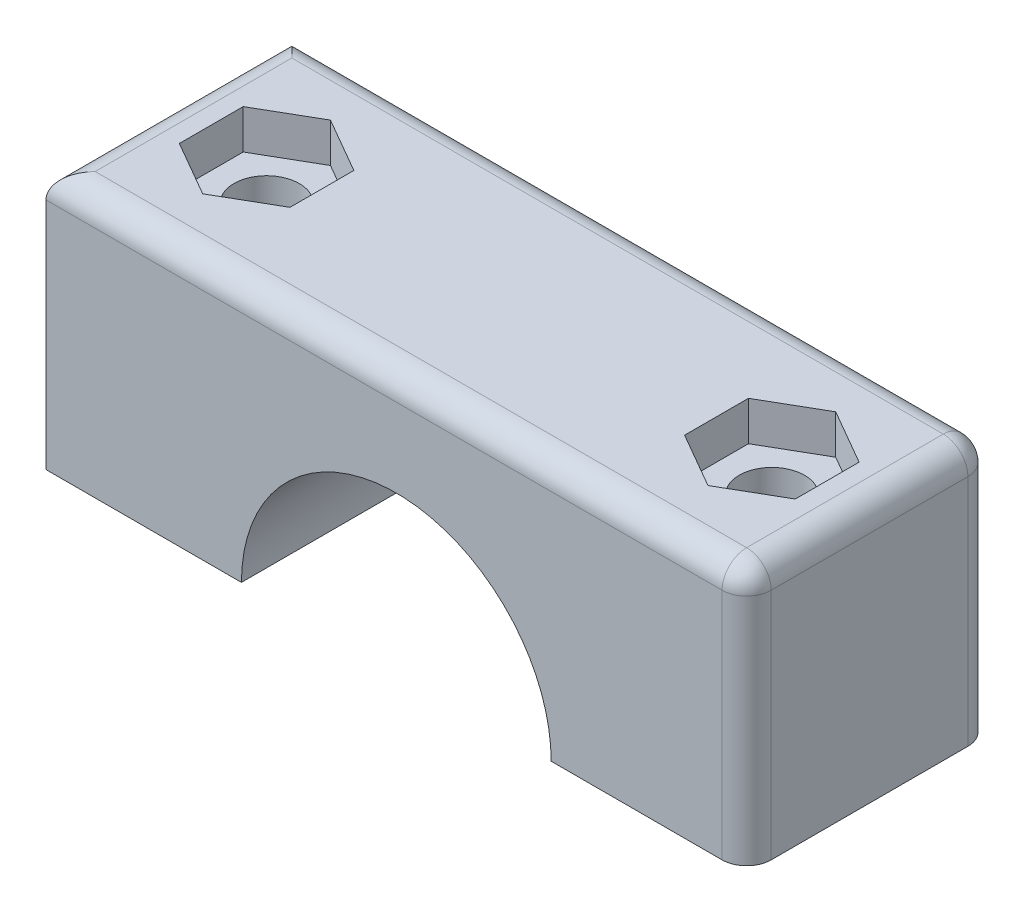
ISO-10303-21;
HEADER;
FILE_DESCRIPTION(('STEP AP214'),'2;1');
FILE_NAME('part.step','',(''),(''),'','','');
FILE_SCHEMA(('AUTOMOTIVE_DESIGN { 1 0 10303 214 1 1 1 1 }'));
ENDSEC;
DATA;
#1=APPLICATION_CONTEXT('core data for automotive mechanical design processes');
#2=APPLICATION_PROTOCOL_DEFINITION('international standard','automotive_design',2000,#1);
#3=PRODUCT_CONTEXT('',#1,'mechanical');
#4=PRODUCT('Part','Part','',(#3));
#5=PRODUCT_RELATED_PRODUCT_CATEGORY('part','',(#4));
#6=PRODUCT_DEFINITION_FORMATION('','',#4);
#7=PRODUCT_DEFINITION_CONTEXT('part definition',#1,'design');
#8=PRODUCT_DEFINITION('design','',#6,#7);
#9=PRODUCT_DEFINITION_SHAPE('','',#8);
#10=(LENGTH_UNIT() NAMED_UNIT(*) SI_UNIT(.MILLI.,.METRE.));
#11=(NAMED_UNIT(*) PLANE_ANGLE_UNIT() SI_UNIT($,.RADIAN.));
#12=(NAMED_UNIT(*) SI_UNIT($,.STERADIAN.) SOLID_ANGLE_UNIT());
#13=UNCERTAINTY_MEASURE_WITH_UNIT(LENGTH_MEASURE(1.E-05),#10,'distance_accuracy_value','');
#14=(GEOMETRIC_REPRESENTATION_CONTEXT(3) GLOBAL_UNCERTAINTY_ASSIGNED_CONTEXT((#13)) GLOBAL_UNIT_ASSIGNED_CONTEXT((#10,
#11,#12)) REPRESENTATION_CONTEXT('',''));
#15=CARTESIAN_POINT('',(0.,0.,0.));
#16=DIRECTION('',(0.,0.,1.));
#17=DIRECTION('',(1.,0.,0.));
#18=AXIS2_PLACEMENT_3D('',#15,#16,#17);
#19=CARTESIAN_POINT('',(-36.195,13.335,12.7));
#20=DIRECTION('',(0.,-1.,0.));
#21=DIRECTION('',(0.,0.,-1.));
#22=AXIS2_PLACEMENT_3D('',#19,#20,#21);
#23=PLANE('',#22);
#24=DIRECTION('',(0.,0.,-1.));
#25=VECTOR('',#24,1.);
#26=CARTESIAN_POINT('',(33.655,13.335,12.7));
#27=LINE('',#26,#25);
#28=CARTESIAN_POINT('',(33.655,13.335,10.16));
#29=VERTEX_POINT('',#28);
#30=CARTESIAN_POINT('',(33.655,13.335,-10.16));
#31=VERTEX_POINT('',#30);
#32=EDGE_CURVE('E343',#29,#31,#27,.T.);
#33=ORIENTED_EDGE('',*,*,#32,.T.);
#34=DIRECTION('',(-1.,0.,0.));
#35=VECTOR('',#34,1.);
#36=CARTESIAN_POINT('',(-36.195,13.335,-10.16));
#37=LINE('',#36,#35);
#38=CARTESIAN_POINT('',(-33.655,13.335,-10.16));
#39=VERTEX_POINT('',#38);
#40=EDGE_CURVE('E43',#31,#39,#37,.T.);
#41=ORIENTED_EDGE('',*,*,#40,.T.);
#42=DIRECTION('',(0.,0.,-1.));
#43=VECTOR('',#42,1.);
#44=CARTESIAN_POINT('',(-33.655,13.335,12.7));
#45=LINE('',#44,#43);
#46=CARTESIAN_POINT('',(-33.655,13.335,10.16));
#47=VERTEX_POINT('',#46);
#48=EDGE_CURVE('E341',#39,#47,#45,.F.);
#49=ORIENTED_EDGE('',*,*,#48,.T.);
#50=DIRECTION('',(-1.,0.,0.));
#51=VECTOR('',#50,1.);
#52=CARTESIAN_POINT('',(36.195,13.335,10.16));
#53=LINE('',#52,#51);
#54=EDGE_CURVE('E339',#47,#29,#53,.F.);
#55=ORIENTED_EDGE('',*,*,#54,.T.);
#56=EDGE_LOOP('',(#33,#41,#49,#55));
#57=FACE_BOUND('',#56,.T.);
#58=DIRECTION('',(0.866025403784439,0.,-0.5));
#59=VECTOR('',#58,1.);
#60=CARTESIAN_POINT('',(-26.1019202053862,13.335,6.59911357683742));
#61=LINE('',#60,#59);
#62=CARTESIAN_POINT('',(-26.1019202053862,13.335,6.59911357683742));
#63=VERTEX_POINT('',#62);
#64=CARTESIAN_POINT('',(-20.3869202053862,13.335,3.29955678841871));
#65=VERTEX_POINT('',#64);
#66=EDGE_CURVE('E258',#63,#65,#61,.T.);
#67=ORIENTED_EDGE('',*,*,#66,.F.);
#68=DIRECTION('',(0.866025403784439,0.,0.5));
#69=VECTOR('',#68,1.);
#70=CARTESIAN_POINT('',(-31.8169202053862,13.335,3.29955678841871));
#71=LINE('',#70,#69);
#72=CARTESIAN_POINT('',(-31.8169202053862,13.335,3.29955678841871));
#73=VERTEX_POINT('',#72);
#74=EDGE_CURVE('E59',#73,#63,#71,.T.);
#75=ORIENTED_EDGE('',*,*,#74,.F.);
#76=DIRECTION('',(0.,0.,1.));
#77=VECTOR('',#76,1.);
#78=CARTESIAN_POINT('',(-31.8169202053862,13.335,-3.29955678841871));
#79=LINE('',#78,#77);
#80=CARTESIAN_POINT('',(-31.8169202053862,13.335,-3.29955678841871));
#81=VERTEX_POINT('',#80);
#82=EDGE_CURVE('E241',#81,#73,#79,.T.);
#83=ORIENTED_EDGE('',*,*,#82,.F.);
#84=DIRECTION('',(-0.866025403784439,0.,0.5));
#85=VECTOR('',#84,1.);
#86=CARTESIAN_POINT('',(-26.1019202053862,13.335,-6.59911357683742));
#87=LINE('',#86,#85);
#88=CARTESIAN_POINT('',(-26.1019202053862,13.335,-6.59911357683742));
#89=VERTEX_POINT('',#88);
#90=EDGE_CURVE('E267',#89,#81,#87,.T.);
#91=ORIENTED_EDGE('',*,*,#90,.F.);
#92=DIRECTION('',(-0.866025403784438,0.,-0.5));
#93=VECTOR('',#92,1.);
#94=CARTESIAN_POINT('',(-20.3869202053862,13.335,-3.29955678841872));
#95=LINE('',#94,#93);
#96=CARTESIAN_POINT('',(-20.3869202053862,13.335,-3.29955678841872));
#97=VERTEX_POINT('',#96);
#98=EDGE_CURVE('E264',#97,#89,#95,.T.);
#99=ORIENTED_EDGE('',*,*,#98,.F.);
#100=DIRECTION('',(0.,0.,-1.));
#101=VECTOR('',#100,1.);
#102=CARTESIAN_POINT('',(-20.3869202053862,13.335,3.29955678841871));
#103=LINE('',#102,#101);
#104=EDGE_CURVE('E261',#65,#97,#103,.T.);
#105=ORIENTED_EDGE('',*,*,#104,.F.);
#106=EDGE_LOOP('',(#67,#75,#83,#91,#99,#105));
#107=FACE_BOUND('',#106,.T.);
#108=DIRECTION('',(-0.866025403784439,0.,0.5));
#109=VECTOR('',#108,1.);
#110=CARTESIAN_POINT('',(31.8169202053862,13.335,3.29955678841871));
#111=LINE('',#110,#109);
#112=CARTESIAN_POINT('',(31.8169202053862,13.335,3.29955678841871));
#113=VERTEX_POINT('',#112);
#114=CARTESIAN_POINT('',(26.1019202053862,13.335,6.59911357683742));
#115=VERTEX_POINT('',#114);
#116=EDGE_CURVE('E51',#113,#115,#111,.T.);
#117=ORIENTED_EDGE('',*,*,#116,.T.);
#118=DIRECTION('',(-0.866025403784439,0.,-0.5));
#119=VECTOR('',#118,1.);
#120=CARTESIAN_POINT('',(26.1019202053862,13.335,6.59911357683742));
#121=LINE('',#120,#119);
#122=CARTESIAN_POINT('',(20.3869202053862,13.335,3.29955678841871));
#123=VERTEX_POINT('',#122);
#124=EDGE_CURVE('E205',#115,#123,#121,.T.);
#125=ORIENTED_EDGE('',*,*,#124,.T.);
#126=DIRECTION('',(0.,0.,-1.));
#127=VECTOR('',#126,1.);
#128=CARTESIAN_POINT('',(20.3869202053862,13.335,3.29955678841871));
#129=LINE('',#128,#127);
#130=CARTESIAN_POINT('',(20.3869202053862,13.335,-3.29955678841872));
#131=VERTEX_POINT('',#130);
#132=EDGE_CURVE('E208',#123,#131,#129,.T.);
#133=ORIENTED_EDGE('',*,*,#132,.T.);
#134=DIRECTION('',(0.866025403784438,0.,-0.5));
#135=VECTOR('',#134,1.);
#136=CARTESIAN_POINT('',(20.3869202053862,13.335,-3.29955678841872));
#137=LINE('',#136,#135);
#138=CARTESIAN_POINT('',(26.1019202053862,13.335,-6.59911357683742));
#139=VERTEX_POINT('',#138);
#140=EDGE_CURVE('E223',#131,#139,#137,.T.);
#141=ORIENTED_EDGE('',*,*,#140,.T.);
#142=DIRECTION('',(0.866025403784439,0.,0.5));
#143=VECTOR('',#142,1.);
#144=CARTESIAN_POINT('',(26.1019202053862,13.335,-6.59911357683742));
#145=LINE('',#144,#143);
#146=CARTESIAN_POINT('',(31.8169202053862,13.335,-3.29955678841871));
#147=VERTEX_POINT('',#146);
#148=EDGE_CURVE('E220',#139,#147,#145,.T.);
#149=ORIENTED_EDGE('',*,*,#148,.T.);
#150=DIRECTION('',(0.,0.,1.));
#151=VECTOR('',#150,1.);
#152=CARTESIAN_POINT('',(31.8169202053862,13.335,-3.29955678841871));
#153=LINE('',#152,#151);
#154=EDGE_CURVE('E218',#147,#113,#153,.T.);
#155=ORIENTED_EDGE('',*,*,#154,.T.);
#156=EDGE_LOOP('',(#117,#125,#133,#141,#149,#155));
#157=FACE_BOUND('',#156,.T.);
#158=ADVANCED_FACE('F34',(#57,#107,#157),#23,.F.);
#159=CARTESIAN_POINT('',(26.1019202053862,-15.875,0.));
#160=DIRECTION('',(0.,1.,0.));
#161=DIRECTION('',(0.,0.,1.));
#162=AXIS2_PLACEMENT_3D('',#159,#160,#161);
#163=CYLINDRICAL_SURFACE('',#162,3.3782);
#164=CARTESIAN_POINT('',(26.1019202053862,-13.335,0.));
#165=DIRECTION('',(0.,1.,0.));
#166=DIRECTION('',(0.,0.,1.));
#167=AXIS2_PLACEMENT_3D('',#164,#165,#166);
#168=CIRCLE('',#167,3.3782);
#169=CARTESIAN_POINT('',(26.1019202053862,-13.335,3.3782));
#170=VERTEX_POINT('',#169);
#171=EDGE_CURVE('E288',#170,#170,#168,.F.);
#172=ORIENTED_EDGE('',*,*,#171,.T.);
#173=EDGE_LOOP('',(#172));
#174=FACE_BOUND('',#173,.T.);
#175=CARTESIAN_POINT('',(26.1019202053862,9.271,0.));
#176=DIRECTION('',(0.,1.,0.));
#177=DIRECTION('',(0.,0.,1.));
#178=AXIS2_PLACEMENT_3D('',#175,#176,#177);
#179=CIRCLE('',#178,3.3782);
#180=CARTESIAN_POINT('',(26.1019202053862,9.271,3.3782));
#181=VERTEX_POINT('',#180);
#182=EDGE_CURVE('E38',#181,#181,#179,.T.);
#183=ORIENTED_EDGE('',*,*,#182,.T.);
#184=EDGE_LOOP('',(#183));
#185=FACE_BOUND('',#184,.T.);
#186=ADVANCED_FACE('F375',(#174,#185),#163,.F.);
#187=CARTESIAN_POINT('',(-26.1019202053862,-15.875,0.));
#188=DIRECTION('',(0.,1.,0.));
#189=DIRECTION('',(0.,0.,1.));
#190=AXIS2_PLACEMENT_3D('',#187,#188,#189);
#191=CYLINDRICAL_SURFACE('',#190,3.3782);
#192=CARTESIAN_POINT('',(-26.1019202053862,-13.335,0.));
#193=DIRECTION('',(0.,1.,0.));
#194=DIRECTION('',(0.,0.,1.));
#195=AXIS2_PLACEMENT_3D('',#192,#193,#194);
#196=CIRCLE('',#195,3.3782);
#197=CARTESIAN_POINT('',(-26.1019202053862,-13.335,3.3782));
#198=VERTEX_POINT('',#197);
#199=EDGE_CURVE('E284',#198,#198,#196,.T.);
#200=ORIENTED_EDGE('',*,*,#199,.F.);
#201=EDGE_LOOP('',(#200));
#202=FACE_BOUND('',#201,.T.);
#203=CARTESIAN_POINT('',(-26.1019202053862,9.271,0.));
#204=DIRECTION('',(0.,1.,0.));
#205=DIRECTION('',(0.,0.,1.));
#206=AXIS2_PLACEMENT_3D('',#203,#204,#205);
#207=CIRCLE('',#206,3.3782);
#208=CARTESIAN_POINT('',(-26.1019202053862,9.271,3.3782));
#209=VERTEX_POINT('',#208);
#210=EDGE_CURVE('E274',#209,#209,#207,.F.);
#211=ORIENTED_EDGE('',*,*,#210,.F.);
#212=EDGE_LOOP('',(#211));
#213=FACE_BOUND('',#212,.T.);
#214=ADVANCED_FACE('F372',(#202,#213),#191,.F.);
#215=CARTESIAN_POINT('',(-36.195,-13.335,12.7));
#216=DIRECTION('',(0.,1.,0.));
#217=DIRECTION('',(0.,0.,1.));
#218=AXIS2_PLACEMENT_3D('',#215,#216,#217);
#219=PLANE('',#218);
#220=ORIENTED_EDGE('',*,*,#199,.T.);
#221=EDGE_LOOP('',(#220));
#222=FACE_BOUND('',#221,.T.);
#223=DIRECTION('',(1.,0.,0.));
#224=VECTOR('',#223,1.);
#225=CARTESIAN_POINT('',(-36.195,-13.335,-12.7));
#226=LINE('',#225,#224);
#227=CARTESIAN_POINT('',(-36.195,-13.335,-12.7));
#228=VERTEX_POINT('',#227);
#229=CARTESIAN_POINT('',(-16.002,-13.335,-12.7));
#230=VERTEX_POINT('',#229);
#231=EDGE_CURVE('E303',#228,#230,#226,.T.);
#232=ORIENTED_EDGE('',*,*,#231,.T.);
#233=DIRECTION('',(0.,0.,1.));
#234=VECTOR('',#233,1.);
#235=CARTESIAN_POINT('',(-16.002,-13.335,-12.7));
#236=LINE('',#235,#234);
#237=CARTESIAN_POINT('',(-16.002,-13.335,12.7));
#238=VERTEX_POINT('',#237);
#239=EDGE_CURVE('E296',#230,#238,#236,.T.);
#240=ORIENTED_EDGE('',*,*,#239,.T.);
#241=DIRECTION('',(1.,0.,0.));
#242=VECTOR('',#241,1.);
#243=CARTESIAN_POINT('',(-36.195,-13.335,12.7));
#244=LINE('',#243,#242);
#245=CARTESIAN_POINT('',(-36.195,-13.335,12.7));
#246=VERTEX_POINT('',#245);
#247=EDGE_CURVE('E304',#246,#238,#244,.T.);
#248=ORIENTED_EDGE('',*,*,#247,.F.);
#249=DIRECTION('',(0.,0.,-1.));
#250=VECTOR('',#249,1.);
#251=CARTESIAN_POINT('',(-36.195,-13.335,12.7));
#252=LINE('',#251,#250);
#253=EDGE_CURVE('E314',#246,#228,#252,.T.);
#254=ORIENTED_EDGE('',*,*,#253,.T.);
#255=EDGE_LOOP('',(#232,#240,#248,#254));
#256=FACE_BOUND('',#255,.T.);
#257=ADVANCED_FACE('F374',(#222,#256),#219,.F.);
#258=CARTESIAN_POINT('',(36.195,13.335,12.7));
#259=DIRECTION('',(-1.,0.,0.));
#260=DIRECTION('',(0.,-1.,0.));
#261=AXIS2_PLACEMENT_3D('',#258,#259,#260);
#262=PLANE('',#261);
#263=DIRECTION('',(0.,0.,-1.));
#264=VECTOR('',#263,1.);
#265=CARTESIAN_POINT('',(36.195,-13.335,12.7));
#266=LINE('',#265,#264);
#267=CARTESIAN_POINT('',(36.195,-13.335,10.16));
#268=VERTEX_POINT('',#267);
#269=CARTESIAN_POINT('',(36.195,-13.335,-10.16));
#270=VERTEX_POINT('',#269);
#271=EDGE_CURVE('E307',#268,#270,#266,.T.);
#272=ORIENTED_EDGE('',*,*,#271,.T.);
#273=DIRECTION('',(0.,1.,0.));
#274=VECTOR('',#273,1.);
#275=CARTESIAN_POINT('',(36.195,13.335,-10.16));
#276=LINE('',#275,#274);
#277=CARTESIAN_POINT('',(36.195,10.795,-10.16));
#278=VERTEX_POINT('',#277);
#279=EDGE_CURVE('E324',#270,#278,#276,.T.);
#280=ORIENTED_EDGE('',*,*,#279,.T.);
#281=DIRECTION('',(0.,0.,-1.));
#282=VECTOR('',#281,1.);
#283=CARTESIAN_POINT('',(36.195,10.795,12.7));
#284=LINE('',#283,#282);
#285=CARTESIAN_POINT('',(36.195,10.795,10.16));
#286=VERTEX_POINT('',#285);
#287=EDGE_CURVE('E317',#278,#286,#284,.F.);
#288=ORIENTED_EDGE('',*,*,#287,.T.);
#289=DIRECTION('',(0.,1.,0.));
#290=VECTOR('',#289,1.);
#291=CARTESIAN_POINT('',(36.195,-13.335,10.16));
#292=LINE('',#291,#290);
#293=EDGE_CURVE('E322',#286,#268,#292,.F.);
#294=ORIENTED_EDGE('',*,*,#293,.T.);
#295=EDGE_LOOP('',(#272,#280,#288,#294));
#296=FACE_BOUND('',#295,.T.);
#297=ADVANCED_FACE('F382',(#296),#262,.F.);
#298=CARTESIAN_POINT('',(-36.195,13.335,12.7));
#299=DIRECTION('',(1.,0.,0.));
#300=DIRECTION('',(0.,0.,-1.));
#301=AXIS2_PLACEMENT_3D('',#298,#299,#300);
#302=PLANE('',#301);
#303=DIRECTION('',(0.,-1.,0.));
#304=VECTOR('',#303,1.);
#305=CARTESIAN_POINT('',(-36.195,13.335,12.7));
#306=LINE('',#305,#304);
#307=CARTESIAN_POINT('',(-36.195,10.795,12.7));
#308=VERTEX_POINT('',#307);
#309=EDGE_CURVE('E300',#308,#246,#306,.T.);
#310=ORIENTED_EDGE('',*,*,#309,.F.);
#311=DIRECTION('',(0.,0.,-1.));
#312=VECTOR('',#311,1.);
#313=CARTESIAN_POINT('',(-36.195,10.795,12.7));
#314=LINE('',#313,#312);
#315=CARTESIAN_POINT('',(-36.195,10.795,-12.7));
#316=VERTEX_POINT('',#315);
#317=EDGE_CURVE('E11',#308,#316,#314,.T.);
#318=ORIENTED_EDGE('',*,*,#317,.T.);
#319=DIRECTION('',(0.,-1.,0.));
#320=VECTOR('',#319,1.);
#321=CARTESIAN_POINT('',(-36.195,13.335,-12.7));
#322=LINE('',#321,#320);
#323=EDGE_CURVE('E299',#316,#228,#322,.T.);
#324=ORIENTED_EDGE('',*,*,#323,.T.);
#325=ORIENTED_EDGE('',*,*,#253,.F.);
#326=EDGE_LOOP('',(#310,#318,#324,#325));
#327=FACE_BOUND('',#326,.T.);
#328=ADVANCED_FACE('F398',(#327),#302,.F.);
#329=ORIENTED_EDGE('',*,*,#171,.F.);
#330=EDGE_LOOP('',(#329));
#331=FACE_BOUND('',#330,.T.);
#332=CARTESIAN_POINT('',(16.002,-13.335,-12.7));
#333=VERTEX_POINT('',#332);
#334=CARTESIAN_POINT('',(33.655,-13.335,-12.7));
#335=VERTEX_POINT('',#334);
#336=EDGE_CURVE('E309',#333,#335,#226,.T.);
#337=ORIENTED_EDGE('',*,*,#336,.T.);
#338=CARTESIAN_POINT('',(33.655,-13.335,-10.16));
#339=DIRECTION('',(0.,1.,0.));
#340=DIRECTION('',(0.,0.,1.));
#341=AXIS2_PLACEMENT_3D('',#338,#339,#340);
#342=CIRCLE('',#341,2.54);
#343=EDGE_CURVE('E333',#335,#270,#342,.F.);
#344=ORIENTED_EDGE('',*,*,#343,.T.);
#345=ORIENTED_EDGE('',*,*,#271,.F.);
#346=CARTESIAN_POINT('',(33.655,-13.335,10.16));
#347=DIRECTION('',(0.,1.,0.));
#348=DIRECTION('',(0.,0.,1.));
#349=AXIS2_PLACEMENT_3D('',#346,#347,#348);
#350=CIRCLE('',#349,2.54);
#351=CARTESIAN_POINT('',(33.655,-13.335,12.7));
#352=VERTEX_POINT('',#351);
#353=EDGE_CURVE('E331',#268,#352,#350,.F.);
#354=ORIENTED_EDGE('',*,*,#353,.T.);
#355=CARTESIAN_POINT('',(16.002,-13.335,12.7));
#356=VERTEX_POINT('',#355);
#357=EDGE_CURVE('E302',#356,#352,#244,.T.);
#358=ORIENTED_EDGE('',*,*,#357,.F.);
#359=DIRECTION('',(0.,0.,1.));
#360=VECTOR('',#359,1.);
#361=CARTESIAN_POINT('',(16.002,-13.335,-12.7));
#362=LINE('',#361,#360);
#363=EDGE_CURVE('E292',#356,#333,#362,.F.);
#364=ORIENTED_EDGE('',*,*,#363,.T.);
#365=EDGE_LOOP('',(#337,#344,#345,#354,#358,#364));
#366=FACE_BOUND('',#365,.T.);
#367=ADVANCED_FACE('F385',(#331,#366),#219,.F.);
#368=CARTESIAN_POINT('',(0.,0.,12.7));
#369=DIRECTION('',(0.,0.,1.));
#370=DIRECTION('',(1.,0.,0.));
#371=AXIS2_PLACEMENT_3D('',#368,#369,#370);
#372=PLANE('',#371);
#373=ORIENTED_EDGE('',*,*,#357,.T.);
#374=DIRECTION('',(0.,1.,0.));
#375=VECTOR('',#374,1.);
#376=CARTESIAN_POINT('',(33.655,13.335,12.7));
#377=LINE('',#376,#375);
#378=CARTESIAN_POINT('',(33.655,10.795,12.7));
#379=VERTEX_POINT('',#378);
#380=EDGE_CURVE('E337',#352,#379,#377,.T.);
#381=ORIENTED_EDGE('',*,*,#380,.T.);
#382=DIRECTION('',(-1.,0.,0.));
#383=VECTOR('',#382,1.);
#384=CARTESIAN_POINT('',(-36.195,10.795,12.7));
#385=LINE('',#384,#383);
#386=EDGE_CURVE('E335',#379,#308,#385,.T.);
#387=ORIENTED_EDGE('',*,*,#386,.T.);
#388=ORIENTED_EDGE('',*,*,#309,.T.);
#389=ORIENTED_EDGE('',*,*,#247,.T.);
#390=CARTESIAN_POINT('',(0.,-13.335,12.7));
#391=DIRECTION('',(0.,0.,1.));
#392=DIRECTION('',(1.,0.,0.));
#393=AXIS2_PLACEMENT_3D('',#390,#391,#392);
#394=CIRCLE('',#393,16.002);
#395=EDGE_CURVE('E287',#356,#238,#394,.T.);
#396=ORIENTED_EDGE('',*,*,#395,.F.);
#397=EDGE_LOOP('',(#373,#381,#387,#388,#389,#396));
#398=FACE_BOUND('',#397,.T.);
#399=ADVANCED_FACE('F456',(#398),#372,.T.);
#400=CARTESIAN_POINT('',(0.,0.,-12.7));
#401=DIRECTION('',(0.,0.,1.));
#402=DIRECTION('',(1.,0.,0.));
#403=AXIS2_PLACEMENT_3D('',#400,#401,#402);
#404=PLANE('',#403);
#405=DIRECTION('',(-1.,0.,0.));
#406=VECTOR('',#405,1.);
#407=CARTESIAN_POINT('',(0.,10.795,-12.7));
#408=LINE('',#407,#406);
#409=CARTESIAN_POINT('',(33.655,10.795,-12.7));
#410=VERTEX_POINT('',#409);
#411=EDGE_CURVE('E327',#316,#410,#408,.F.);
#412=ORIENTED_EDGE('',*,*,#411,.T.);
#413=DIRECTION('',(0.,1.,0.));
#414=VECTOR('',#413,1.);
#415=CARTESIAN_POINT('',(33.655,0.,-12.7));
#416=LINE('',#415,#414);
#417=EDGE_CURVE('E329',#410,#335,#416,.F.);
#418=ORIENTED_EDGE('',*,*,#417,.T.);
#419=ORIENTED_EDGE('',*,*,#336,.F.);
#420=CARTESIAN_POINT('',(0.,-13.335,-12.7));
#421=DIRECTION('',(0.,0.,1.));
#422=DIRECTION('',(1.,0.,0.));
#423=AXIS2_PLACEMENT_3D('',#420,#421,#422);
#424=CIRCLE('',#423,16.002);
#425=EDGE_CURVE('E289',#333,#230,#424,.T.);
#426=ORIENTED_EDGE('',*,*,#425,.T.);
#427=ORIENTED_EDGE('',*,*,#231,.F.);
#428=ORIENTED_EDGE('',*,*,#323,.F.);
#429=EDGE_LOOP('',(#412,#418,#419,#426,#427,#428));
#430=FACE_BOUND('',#429,.T.);
#431=ADVANCED_FACE('F448',(#430),#404,.F.);
#432=CARTESIAN_POINT('',(0.,-13.335,-12.7));
#433=DIRECTION('',(0.,0.,1.));
#434=DIRECTION('',(1.,0.,0.));
#435=AXIS2_PLACEMENT_3D('',#432,#433,#434);
#436=CYLINDRICAL_SURFACE('',#435,16.002);
#437=ORIENTED_EDGE('',*,*,#425,.F.);
#438=ORIENTED_EDGE('',*,*,#363,.F.);
#439=ORIENTED_EDGE('',*,*,#395,.T.);
#440=ORIENTED_EDGE('',*,*,#239,.F.);
#441=EDGE_LOOP('',(#437,#438,#439,#440));
#442=FACE_BOUND('',#441,.T.);
#443=ADVANCED_FACE('F431',(#442),#436,.F.);
#444=CARTESIAN_POINT('',(33.655,0.,10.16));
#445=DIRECTION('',(0.,-1.,0.));
#446=DIRECTION('',(1.,0.,0.));
#447=AXIS2_PLACEMENT_3D('',#444,#445,#446);
#448=CYLINDRICAL_SURFACE('',#447,2.54);
#449=ORIENTED_EDGE('',*,*,#353,.F.);
#450=ORIENTED_EDGE('',*,*,#293,.F.);
#451=CARTESIAN_POINT('',(33.655,10.795,10.16));
#452=DIRECTION('',(0.,1.,0.));
#453=DIRECTION('',(0.,0.,1.));
#454=AXIS2_PLACEMENT_3D('',#451,#452,#453);
#455=CIRCLE('',#454,2.54);
#456=EDGE_CURVE('E320',#379,#286,#455,.T.);
#457=ORIENTED_EDGE('',*,*,#456,.F.);
#458=ORIENTED_EDGE('',*,*,#380,.F.);
#459=EDGE_LOOP('',(#449,#450,#457,#458));
#460=FACE_BOUND('',#459,.T.);
#461=ADVANCED_FACE('F36',(#460),#448,.T.);
#462=CARTESIAN_POINT('',(0.,10.795,10.16));
#463=DIRECTION('',(1.,0.,0.));
#464=DIRECTION('',(0.,0.,-1.));
#465=AXIS2_PLACEMENT_3D('',#462,#463,#464);
#466=CYLINDRICAL_SURFACE('',#465,2.54);
#467=CARTESIAN_POINT('',(-33.655,10.795,10.16));
#468=DIRECTION('',(0.707106781186547,0.,0.707106781186547));
#469=DIRECTION('',(0.707106781186547,0.,-0.707106781186547));
#470=AXIS2_PLACEMENT_3D('',#467,#468,#469);
#471=ELLIPSE('',#470,3.59210244842766,2.54);
#472=EDGE_CURVE('E360',#308,#47,#471,.F.);
#473=ORIENTED_EDGE('',*,*,#472,.F.);
#474=ORIENTED_EDGE('',*,*,#386,.F.);
#475=CARTESIAN_POINT('',(33.655,10.795,10.16));
#476=DIRECTION('',(1.,0.,0.));
#477=DIRECTION('',(0.,0.,-1.));
#478=AXIS2_PLACEMENT_3D('',#475,#476,#477);
#479=CIRCLE('',#478,2.54);
#480=EDGE_CURVE('E363',#29,#379,#479,.T.);
#481=ORIENTED_EDGE('',*,*,#480,.F.);
#482=ORIENTED_EDGE('',*,*,#54,.F.);
#483=EDGE_LOOP('',(#473,#474,#481,#482));
#484=FACE_BOUND('',#483,.T.);
#485=ADVANCED_FACE('F424',(#484),#466,.T.);
#486=CARTESIAN_POINT('',(33.655,10.795,10.16));
#487=DIRECTION('',(0.,0.,1.));
#488=DIRECTION('',(1.,0.,0.));
#489=AXIS2_PLACEMENT_3D('',#486,#487,#488);
#490=SPHERICAL_SURFACE('',#489,2.54);
#491=ORIENTED_EDGE('',*,*,#480,.T.);
#492=ORIENTED_EDGE('',*,*,#456,.T.);
#493=CARTESIAN_POINT('',(33.655,10.795,10.16));
#494=DIRECTION('',(0.,0.,1.));
#495=DIRECTION('',(1.,0.,0.));
#496=AXIS2_PLACEMENT_3D('',#493,#494,#495);
#497=CIRCLE('',#496,2.54);
#498=EDGE_CURVE('E357',#29,#286,#497,.F.);
#499=ORIENTED_EDGE('',*,*,#498,.F.);
#500=EDGE_LOOP('',(#491,#492,#499));
#501=FACE_BOUND('',#500,.T.);
#502=ADVANCED_FACE('F421',(#501),#490,.T.);
#503=CARTESIAN_POINT('',(-33.655,10.795,12.7));
#504=DIRECTION('',(0.,0.,-1.));
#505=DIRECTION('',(-1.,0.,0.));
#506=AXIS2_PLACEMENT_3D('',#503,#504,#505);
#507=CYLINDRICAL_SURFACE('',#506,2.54);
#508=ORIENTED_EDGE('',*,*,#472,.T.);
#509=ORIENTED_EDGE('',*,*,#48,.F.);
#510=CARTESIAN_POINT('',(-33.655,10.795,-10.16));
#511=DIRECTION('',(-0.707106781186547,0.,0.707106781186547));
#512=DIRECTION('',(-0.707106781186547,0.,-0.707106781186547));
#513=AXIS2_PLACEMENT_3D('',#510,#511,#512);
#514=ELLIPSE('',#513,3.59210244842766,2.54);
#515=EDGE_CURVE('E354',#316,#39,#514,.F.);
#516=ORIENTED_EDGE('',*,*,#515,.F.);
#517=ORIENTED_EDGE('',*,*,#317,.F.);
#518=EDGE_LOOP('',(#508,#509,#516,#517));
#519=FACE_BOUND('',#518,.T.);
#520=ADVANCED_FACE('F417',(#519),#507,.T.);
#521=CARTESIAN_POINT('',(33.655,10.795,12.7));
#522=DIRECTION('',(0.,0.,-1.));
#523=DIRECTION('',(-1.,0.,0.));
#524=AXIS2_PLACEMENT_3D('',#521,#522,#523);
#525=CYLINDRICAL_SURFACE('',#524,2.54);
#526=ORIENTED_EDGE('',*,*,#498,.T.);
#527=ORIENTED_EDGE('',*,*,#287,.F.);
#528=CARTESIAN_POINT('',(33.655,10.795,-10.16));
#529=DIRECTION('',(0.,0.,-1.));
#530=DIRECTION('',(-1.,0.,0.));
#531=AXIS2_PLACEMENT_3D('',#528,#529,#530);
#532=CIRCLE('',#531,2.54);
#533=EDGE_CURVE('E351',#31,#278,#532,.T.);
#534=ORIENTED_EDGE('',*,*,#533,.F.);
#535=ORIENTED_EDGE('',*,*,#32,.F.);
#536=EDGE_LOOP('',(#526,#527,#534,#535));
#537=FACE_BOUND('',#536,.T.);
#538=ADVANCED_FACE('F413',(#537),#525,.T.);
#539=CARTESIAN_POINT('',(-36.195,10.795,-10.16));
#540=DIRECTION('',(-1.,0.,0.));
#541=DIRECTION('',(0.,0.,1.));
#542=AXIS2_PLACEMENT_3D('',#539,#540,#541);
#543=CYLINDRICAL_SURFACE('',#542,2.54);
#544=ORIENTED_EDGE('',*,*,#515,.T.);
#545=ORIENTED_EDGE('',*,*,#40,.F.);
#546=CARTESIAN_POINT('',(33.655,10.795,-10.16));
#547=DIRECTION('',(1.,0.,0.));
#548=DIRECTION('',(0.,0.,-1.));
#549=AXIS2_PLACEMENT_3D('',#546,#547,#548);
#550=CIRCLE('',#549,2.54);
#551=EDGE_CURVE('E349',#410,#31,#550,.T.);
#552=ORIENTED_EDGE('',*,*,#551,.F.);
#553=ORIENTED_EDGE('',*,*,#411,.F.);
#554=EDGE_LOOP('',(#544,#545,#552,#553));
#555=FACE_BOUND('',#554,.T.);
#556=ADVANCED_FACE('F409',(#555),#543,.T.);
#557=CARTESIAN_POINT('',(33.655,10.795,-10.16));
#558=DIRECTION('',(0.,0.,1.));
#559=DIRECTION('',(1.,0.,0.));
#560=AXIS2_PLACEMENT_3D('',#557,#558,#559);
#561=SPHERICAL_SURFACE('',#560,2.54);
#562=ORIENTED_EDGE('',*,*,#551,.T.);
#563=ORIENTED_EDGE('',*,*,#533,.T.);
#564=CARTESIAN_POINT('',(33.655,10.795,-10.16));
#565=DIRECTION('',(0.,1.,0.));
#566=DIRECTION('',(0.,0.,1.));
#567=AXIS2_PLACEMENT_3D('',#564,#565,#566);
#568=CIRCLE('',#567,2.54);
#569=EDGE_CURVE('E347',#410,#278,#568,.F.);
#570=ORIENTED_EDGE('',*,*,#569,.F.);
#571=EDGE_LOOP('',(#562,#563,#570));
#572=FACE_BOUND('',#571,.T.);
#573=ADVANCED_FACE('F405',(#572),#561,.T.);
#574=CARTESIAN_POINT('',(33.655,13.335,-10.16));
#575=DIRECTION('',(0.,1.,0.));
#576=DIRECTION('',(-1.,0.,0.));
#577=AXIS2_PLACEMENT_3D('',#574,#575,#576);
#578=CYLINDRICAL_SURFACE('',#577,2.54);
#579=ORIENTED_EDGE('',*,*,#343,.F.);
#580=ORIENTED_EDGE('',*,*,#417,.F.);
#581=ORIENTED_EDGE('',*,*,#569,.T.);
#582=ORIENTED_EDGE('',*,*,#279,.F.);
#583=EDGE_LOOP('',(#579,#580,#581,#582));
#584=FACE_BOUND('',#583,.T.);
#585=ADVANCED_FACE('F402',(#584),#578,.T.);
#586=CARTESIAN_POINT('',(0.,9.271,0.));
#587=DIRECTION('',(0.,1.,0.));
#588=DIRECTION('',(0.,0.,1.));
#589=AXIS2_PLACEMENT_3D('',#586,#587,#588);
#590=PLANE('',#589);
#591=DIRECTION('',(0.866025403784439,0.,0.5));
#592=VECTOR('',#591,1.);
#593=CARTESIAN_POINT('',(-31.8169202053862,9.271,3.29955678841871));
#594=LINE('',#593,#592);
#595=CARTESIAN_POINT('',(-31.8169202053862,9.271,3.29955678841871));
#596=VERTEX_POINT('',#595);
#597=CARTESIAN_POINT('',(-26.1019202053862,9.271,6.59911357683742));
#598=VERTEX_POINT('',#597);
#599=EDGE_CURVE('E237',#596,#598,#594,.T.);
#600=ORIENTED_EDGE('',*,*,#599,.T.);
#601=DIRECTION('',(0.866025403784439,0.,-0.5));
#602=VECTOR('',#601,1.);
#603=CARTESIAN_POINT('',(-26.1019202053862,9.271,6.59911357683742));
#604=LINE('',#603,#602);
#605=CARTESIAN_POINT('',(-20.3869202053862,9.271,3.29955678841871));
#606=VERTEX_POINT('',#605);
#607=EDGE_CURVE('E240',#598,#606,#604,.T.);
#608=ORIENTED_EDGE('',*,*,#607,.T.);
#609=DIRECTION('',(0.,0.,-1.));
#610=VECTOR('',#609,1.);
#611=CARTESIAN_POINT('',(-20.3869202053862,9.271,3.29955678841871));
#612=LINE('',#611,#610);
#613=CARTESIAN_POINT('',(-20.3869202053862,9.271,-3.29955678841872));
#614=VERTEX_POINT('',#613);
#615=EDGE_CURVE('E244',#606,#614,#612,.T.);
#616=ORIENTED_EDGE('',*,*,#615,.T.);
#617=DIRECTION('',(-0.866025403784438,0.,-0.5));
#618=VECTOR('',#617,1.);
#619=CARTESIAN_POINT('',(-20.3869202053862,9.271,-3.29955678841872));
#620=LINE('',#619,#618);
#621=CARTESIAN_POINT('',(-26.1019202053862,9.271,-6.59911357683742));
#622=VERTEX_POINT('',#621);
#623=EDGE_CURVE('E247',#614,#622,#620,.T.);
#624=ORIENTED_EDGE('',*,*,#623,.T.);
#625=DIRECTION('',(-0.866025403784439,0.,0.5));
#626=VECTOR('',#625,1.);
#627=CARTESIAN_POINT('',(-26.1019202053862,9.271,-6.59911357683742));
#628=LINE('',#627,#626);
#629=CARTESIAN_POINT('',(-31.8169202053862,9.271,-3.29955678841871));
#630=VERTEX_POINT('',#629);
#631=EDGE_CURVE('E250',#622,#630,#628,.T.);
#632=ORIENTED_EDGE('',*,*,#631,.T.);
#633=DIRECTION('',(0.,0.,1.));
#634=VECTOR('',#633,1.);
#635=CARTESIAN_POINT('',(-31.8169202053862,9.271,-3.29955678841871));
#636=LINE('',#635,#634);
#637=EDGE_CURVE('E253',#630,#596,#636,.T.);
#638=ORIENTED_EDGE('',*,*,#637,.T.);
#639=EDGE_LOOP('',(#600,#608,#616,#624,#632,#638));
#640=FACE_BOUND('',#639,.T.);
#641=ORIENTED_EDGE('',*,*,#210,.T.);
#642=EDGE_LOOP('',(#641));
#643=FACE_BOUND('',#642,.T.);
#644=ADVANCED_FACE('F370',(#640,#643),#590,.T.);
#645=CARTESIAN_POINT('',(-31.8169202053862,9.271,3.29955678841871));
#646=DIRECTION('',(-0.5,0.,0.866025403784439));
#647=DIRECTION('',(0.866025403784439,0.,0.5));
#648=AXIS2_PLACEMENT_3D('',#645,#646,#647);
#649=PLANE('',#648);
#650=ORIENTED_EDGE('',*,*,#74,.T.);
#651=DIRECTION('',(0.,1.,0.));
#652=VECTOR('',#651,1.);
#653=CARTESIAN_POINT('',(-26.1019202053862,9.271,6.59911357683742));
#654=LINE('',#653,#652);
#655=EDGE_CURVE('E256',#598,#63,#654,.T.);
#656=ORIENTED_EDGE('',*,*,#655,.F.);
#657=ORIENTED_EDGE('',*,*,#599,.F.);
#658=DIRECTION('',(0.,1.,0.));
#659=VECTOR('',#658,1.);
#660=CARTESIAN_POINT('',(-31.8169202053862,9.271,3.29955678841871));
#661=LINE('',#660,#659);
#662=EDGE_CURVE('E272',#596,#73,#661,.T.);
#663=ORIENTED_EDGE('',*,*,#662,.T.);
#664=EDGE_LOOP('',(#650,#656,#657,#663));
#665=FACE_BOUND('',#664,.T.);
#666=ADVANCED_FACE('F519',(#665),#649,.F.);
#667=CARTESIAN_POINT('',(-31.8169202053862,9.271,-3.29955678841871));
#668=DIRECTION('',(-1.,0.,0.));
#669=DIRECTION('',(0.,0.,1.));
#670=AXIS2_PLACEMENT_3D('',#667,#668,#669);
#671=PLANE('',#670);
#672=ORIENTED_EDGE('',*,*,#82,.T.);
#673=ORIENTED_EDGE('',*,*,#662,.F.);
#674=ORIENTED_EDGE('',*,*,#637,.F.);
#675=DIRECTION('',(0.,1.,0.));
#676=VECTOR('',#675,1.);
#677=CARTESIAN_POINT('',(-31.8169202053862,9.271,-3.29955678841871));
#678=LINE('',#677,#676);
#679=EDGE_CURVE('E275',#630,#81,#678,.T.);
#680=ORIENTED_EDGE('',*,*,#679,.T.);
#681=EDGE_LOOP('',(#672,#673,#674,#680));
#682=FACE_BOUND('',#681,.T.);
#683=ADVANCED_FACE('F521',(#682),#671,.F.);
#684=CARTESIAN_POINT('',(-26.1019202053862,9.271,-6.59911357683742));
#685=DIRECTION('',(-0.5,0.,-0.866025403784439));
#686=DIRECTION('',(-0.866025403784439,0.,0.5));
#687=AXIS2_PLACEMENT_3D('',#684,#685,#686);
#688=PLANE('',#687);
#689=ORIENTED_EDGE('',*,*,#90,.T.);
#690=ORIENTED_EDGE('',*,*,#679,.F.);
#691=ORIENTED_EDGE('',*,*,#631,.F.);
#692=DIRECTION('',(0.,1.,0.));
#693=VECTOR('',#692,1.);
#694=CARTESIAN_POINT('',(-26.1019202053862,9.271,-6.59911357683742));
#695=LINE('',#694,#693);
#696=EDGE_CURVE('E277',#622,#89,#695,.T.);
#697=ORIENTED_EDGE('',*,*,#696,.T.);
#698=EDGE_LOOP('',(#689,#690,#691,#697));
#699=FACE_BOUND('',#698,.T.);
#700=ADVANCED_FACE('F524',(#699),#688,.F.);
#701=CARTESIAN_POINT('',(-20.3869202053862,9.271,-3.29955678841872));
#702=DIRECTION('',(0.5,0.,-0.866025403784439));
#703=DIRECTION('',(-0.866025403784439,0.,-0.5));
#704=AXIS2_PLACEMENT_3D('',#701,#702,#703);
#705=PLANE('',#704);
#706=ORIENTED_EDGE('',*,*,#98,.T.);
#707=ORIENTED_EDGE('',*,*,#696,.F.);
#708=ORIENTED_EDGE('',*,*,#623,.F.);
#709=DIRECTION('',(0.,1.,0.));
#710=VECTOR('',#709,1.);
#711=CARTESIAN_POINT('',(-20.3869202053862,9.271,-3.29955678841872));
#712=LINE('',#711,#710);
#713=EDGE_CURVE('E279',#614,#97,#712,.T.);
#714=ORIENTED_EDGE('',*,*,#713,.T.);
#715=EDGE_LOOP('',(#706,#707,#708,#714));
#716=FACE_BOUND('',#715,.T.);
#717=ADVANCED_FACE('F528',(#716),#705,.F.);
#718=CARTESIAN_POINT('',(-20.3869202053862,9.271,3.29955678841871));
#719=DIRECTION('',(1.,0.,0.));
#720=DIRECTION('',(0.,0.,-1.));
#721=AXIS2_PLACEMENT_3D('',#718,#719,#720);
#722=PLANE('',#721);
#723=ORIENTED_EDGE('',*,*,#104,.T.);
#724=ORIENTED_EDGE('',*,*,#713,.F.);
#725=ORIENTED_EDGE('',*,*,#615,.F.);
#726=DIRECTION('',(0.,1.,0.));
#727=VECTOR('',#726,1.);
#728=CARTESIAN_POINT('',(-20.3869202053862,9.271,3.29955678841871));
#729=LINE('',#728,#727);
#730=EDGE_CURVE('E281',#606,#65,#729,.T.);
#731=ORIENTED_EDGE('',*,*,#730,.T.);
#732=EDGE_LOOP('',(#723,#724,#725,#731));
#733=FACE_BOUND('',#732,.T.);
#734=ADVANCED_FACE('F532',(#733),#722,.F.);
#735=CARTESIAN_POINT('',(-26.1019202053862,9.271,6.59911357683742));
#736=DIRECTION('',(0.5,0.,0.866025403784439));
#737=DIRECTION('',(0.866025403784439,0.,-0.5));
#738=AXIS2_PLACEMENT_3D('',#735,#736,#737);
#739=PLANE('',#738);
#740=ORIENTED_EDGE('',*,*,#66,.T.);
#741=ORIENTED_EDGE('',*,*,#730,.F.);
#742=ORIENTED_EDGE('',*,*,#607,.F.);
#743=ORIENTED_EDGE('',*,*,#655,.T.);
#744=EDGE_LOOP('',(#740,#741,#742,#743));
#745=FACE_BOUND('',#744,.T.);
#746=ADVANCED_FACE('F516',(#745),#739,.F.);
#747=CARTESIAN_POINT('',(31.8169202053862,9.271,3.29955678841871));
#748=DIRECTION('',(-0.5,0.,-0.866025403784439));
#749=DIRECTION('',(-0.866025403784439,0.,0.5));
#750=AXIS2_PLACEMENT_3D('',#747,#748,#749);
#751=PLANE('',#750);
#752=ORIENTED_EDGE('',*,*,#116,.F.);
#753=DIRECTION('',(0.,1.,0.));
#754=VECTOR('',#753,1.);
#755=CARTESIAN_POINT('',(31.8169202053862,9.271,3.29955678841871));
#756=LINE('',#755,#754);
#757=CARTESIAN_POINT('',(31.8169202053862,9.271,3.29955678841871));
#758=VERTEX_POINT('',#757);
#759=EDGE_CURVE('E189',#758,#113,#756,.T.);
#760=ORIENTED_EDGE('',*,*,#759,.F.);
#761=DIRECTION('',(-0.866025403784439,0.,0.5));
#762=VECTOR('',#761,1.);
#763=CARTESIAN_POINT('',(31.8169202053862,9.271,3.29955678841871));
#764=LINE('',#763,#762);
#765=CARTESIAN_POINT('',(26.1019202053862,9.271,6.59911357683742));
#766=VERTEX_POINT('',#765);
#767=EDGE_CURVE('E196',#758,#766,#764,.T.);
#768=ORIENTED_EDGE('',*,*,#767,.T.);
#769=DIRECTION('',(0.,1.,0.));
#770=VECTOR('',#769,1.);
#771=CARTESIAN_POINT('',(26.1019202053862,9.271,6.59911357683742));
#772=LINE('',#771,#770);
#773=EDGE_CURVE('E228',#766,#115,#772,.T.);
#774=ORIENTED_EDGE('',*,*,#773,.T.);
#775=EDGE_LOOP('',(#752,#760,#768,#774));
#776=FACE_BOUND('',#775,.T.);
#777=ADVANCED_FACE('F199',(#776),#751,.T.);
#778=CARTESIAN_POINT('',(26.1019202053862,9.271,6.59911357683742));
#779=DIRECTION('',(0.5,0.,-0.866025403784439));
#780=DIRECTION('',(-0.866025403784439,0.,-0.5));
#781=AXIS2_PLACEMENT_3D('',#778,#779,#780);
#782=PLANE('',#781);
#783=ORIENTED_EDGE('',*,*,#124,.F.);
#784=ORIENTED_EDGE('',*,*,#773,.F.);
#785=DIRECTION('',(-0.866025403784439,0.,-0.5));
#786=VECTOR('',#785,1.);
#787=CARTESIAN_POINT('',(26.1019202053862,9.271,6.59911357683742));
#788=LINE('',#787,#786);
#789=CARTESIAN_POINT('',(20.3869202053862,9.271,3.29955678841871));
#790=VERTEX_POINT('',#789);
#791=EDGE_CURVE('E201',#766,#790,#788,.T.);
#792=ORIENTED_EDGE('',*,*,#791,.T.);
#793=DIRECTION('',(0.,1.,0.));
#794=VECTOR('',#793,1.);
#795=CARTESIAN_POINT('',(20.3869202053862,9.271,3.29955678841871));
#796=LINE('',#795,#794);
#797=EDGE_CURVE('E230',#790,#123,#796,.T.);
#798=ORIENTED_EDGE('',*,*,#797,.T.);
#799=EDGE_LOOP('',(#783,#784,#792,#798));
#800=FACE_BOUND('',#799,.T.);
#801=ADVANCED_FACE('F499',(#800),#782,.T.);
#802=CARTESIAN_POINT('',(20.3869202053862,9.271,3.29955678841871));
#803=DIRECTION('',(1.,0.,0.));
#804=DIRECTION('',(0.,0.,-1.));
#805=AXIS2_PLACEMENT_3D('',#802,#803,#804);
#806=PLANE('',#805);
#807=ORIENTED_EDGE('',*,*,#132,.F.);
#808=ORIENTED_EDGE('',*,*,#797,.F.);
#809=DIRECTION('',(0.,0.,-1.));
#810=VECTOR('',#809,1.);
#811=CARTESIAN_POINT('',(20.3869202053862,9.271,3.29955678841871));
#812=LINE('',#811,#810);
#813=CARTESIAN_POINT('',(20.3869202053862,9.271,-3.29955678841872));
#814=VERTEX_POINT('',#813);
#815=EDGE_CURVE('E214',#790,#814,#812,.T.);
#816=ORIENTED_EDGE('',*,*,#815,.T.);
#817=DIRECTION('',(0.,1.,0.));
#818=VECTOR('',#817,1.);
#819=CARTESIAN_POINT('',(20.3869202053862,9.271,-3.29955678841872));
#820=LINE('',#819,#818);
#821=EDGE_CURVE('E232',#814,#131,#820,.T.);
#822=ORIENTED_EDGE('',*,*,#821,.T.);
#823=EDGE_LOOP('',(#807,#808,#816,#822));
#824=FACE_BOUND('',#823,.T.);
#825=ADVANCED_FACE('F502',(#824),#806,.T.);
#826=CARTESIAN_POINT('',(20.3869202053862,9.271,-3.29955678841872));
#827=DIRECTION('',(0.5,0.,0.866025403784439));
#828=DIRECTION('',(0.866025403784439,0.,-0.5));
#829=AXIS2_PLACEMENT_3D('',#826,#827,#828);
#830=PLANE('',#829);
#831=ORIENTED_EDGE('',*,*,#140,.F.);
#832=ORIENTED_EDGE('',*,*,#821,.F.);
#833=DIRECTION('',(0.866025403784438,0.,-0.5));
#834=VECTOR('',#833,1.);
#835=CARTESIAN_POINT('',(20.3869202053862,9.271,-3.29955678841872));
#836=LINE('',#835,#834);
#837=CARTESIAN_POINT('',(26.1019202053862,9.271,-6.59911357683742));
#838=VERTEX_POINT('',#837);
#839=EDGE_CURVE('E212',#814,#838,#836,.T.);
#840=ORIENTED_EDGE('',*,*,#839,.T.);
#841=DIRECTION('',(0.,1.,0.));
#842=VECTOR('',#841,1.);
#843=CARTESIAN_POINT('',(26.1019202053862,9.271,-6.59911357683742));
#844=LINE('',#843,#842);
#845=EDGE_CURVE('E234',#838,#139,#844,.T.);
#846=ORIENTED_EDGE('',*,*,#845,.T.);
#847=EDGE_LOOP('',(#831,#832,#840,#846));
#848=FACE_BOUND('',#847,.T.);
#849=ADVANCED_FACE('F506',(#848),#830,.T.);
#850=CARTESIAN_POINT('',(26.1019202053862,9.271,-6.59911357683742));
#851=DIRECTION('',(-0.5,0.,0.866025403784439));
#852=DIRECTION('',(0.866025403784439,0.,0.5));
#853=AXIS2_PLACEMENT_3D('',#850,#851,#852);
#854=PLANE('',#853);
#855=ORIENTED_EDGE('',*,*,#148,.F.);
#856=ORIENTED_EDGE('',*,*,#845,.F.);
#857=DIRECTION('',(0.866025403784439,0.,0.5));
#858=VECTOR('',#857,1.);
#859=CARTESIAN_POINT('',(26.1019202053862,9.271,-6.59911357683742));
#860=LINE('',#859,#858);
#861=CARTESIAN_POINT('',(31.8169202053862,9.271,-3.29955678841871));
#862=VERTEX_POINT('',#861);
#863=EDGE_CURVE('E195',#838,#862,#860,.T.);
#864=ORIENTED_EDGE('',*,*,#863,.T.);
#865=DIRECTION('',(0.,1.,0.));
#866=VECTOR('',#865,1.);
#867=CARTESIAN_POINT('',(31.8169202053862,9.271,-3.29955678841871));
#868=LINE('',#867,#866);
#869=EDGE_CURVE('E191',#862,#147,#868,.T.);
#870=ORIENTED_EDGE('',*,*,#869,.T.);
#871=EDGE_LOOP('',(#855,#856,#864,#870));
#872=FACE_BOUND('',#871,.T.);
#873=ADVANCED_FACE('F496',(#872),#854,.T.);
#874=CARTESIAN_POINT('',(31.8169202053862,9.271,-3.29955678841871));
#875=DIRECTION('',(-1.,0.,0.));
#876=DIRECTION('',(0.,0.,1.));
#877=AXIS2_PLACEMENT_3D('',#874,#875,#876);
#878=PLANE('',#877);
#879=ORIENTED_EDGE('',*,*,#154,.F.);
#880=ORIENTED_EDGE('',*,*,#869,.F.);
#881=DIRECTION('',(0.,0.,1.));
#882=VECTOR('',#881,1.);
#883=CARTESIAN_POINT('',(31.8169202053862,9.271,-3.29955678841871));
#884=LINE('',#883,#882);
#885=EDGE_CURVE('E186',#862,#758,#884,.T.);
#886=ORIENTED_EDGE('',*,*,#885,.T.);
#887=ORIENTED_EDGE('',*,*,#759,.T.);
#888=EDGE_LOOP('',(#879,#880,#886,#887));
#889=FACE_BOUND('',#888,.T.);
#890=ADVANCED_FACE('F188',(#889),#878,.T.);
#891=CARTESIAN_POINT('',(0.,9.271,0.));
#892=DIRECTION('',(0.,1.,0.));
#893=DIRECTION('',(0.,0.,1.));
#894=AXIS2_PLACEMENT_3D('',#891,#892,#893);
#895=PLANE('',#894);
#896=ORIENTED_EDGE('',*,*,#182,.F.);
#897=EDGE_LOOP('',(#896));
#898=FACE_BOUND('',#897,.T.);
#899=ORIENTED_EDGE('',*,*,#767,.F.);
#900=ORIENTED_EDGE('',*,*,#885,.F.);
#901=ORIENTED_EDGE('',*,*,#863,.F.);
#902=ORIENTED_EDGE('',*,*,#839,.F.);
#903=ORIENTED_EDGE('',*,*,#815,.F.);
#904=ORIENTED_EDGE('',*,*,#791,.F.);
#905=EDGE_LOOP('',(#899,#900,#901,#902,#903,#904));
#906=FACE_BOUND('',#905,.T.);
#907=ADVANCED_FACE('F203',(#898,#906),#895,.T.);
#908=CLOSED_SHELL('',(#158,#186,#214,#257,#297,#328,#367,#399,#431,#443,#461,#485,#502,#520,
#538,#556,#573,#585,#644,#666,#683,#700,#717,#734,#746,#777,#801,#825,#849,#873,#890,#907));
#909=MANIFOLD_SOLID_BREP('B2',#908);
#910=ADVANCED_BREP_SHAPE_REPRESENTATION('',(#18,#909),#14);
#911=SHAPE_DEFINITION_REPRESENTATION(#9,#910);
ENDSEC;
END-ISO-10303-21;
